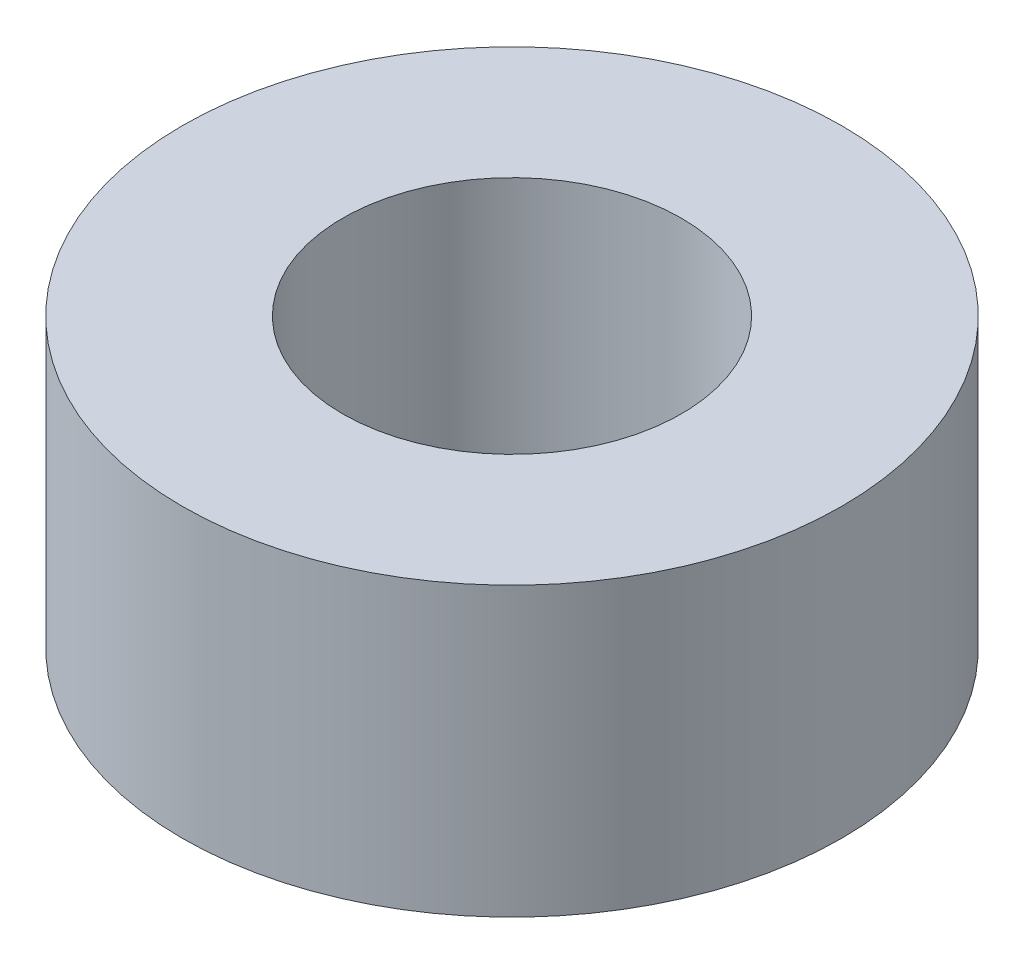
ISO-10303-21;
HEADER;
FILE_DESCRIPTION(('STEP AP214'),'2;1');
FILE_NAME('part.step','',(''),(''),'','','');
FILE_SCHEMA(('AUTOMOTIVE_DESIGN { 1 0 10303 214 1 1 1 1 }'));
ENDSEC;
DATA;
#1=APPLICATION_CONTEXT('core data for automotive mechanical design processes');
#2=APPLICATION_PROTOCOL_DEFINITION('international standard','automotive_design',2000,#1);
#3=PRODUCT_CONTEXT('',#1,'mechanical');
#4=PRODUCT('Part','Part','',(#3));
#5=PRODUCT_RELATED_PRODUCT_CATEGORY('part','',(#4));
#6=PRODUCT_DEFINITION_FORMATION('','',#4);
#7=PRODUCT_DEFINITION_CONTEXT('part definition',#1,'design');
#8=PRODUCT_DEFINITION('design','',#6,#7);
#9=PRODUCT_DEFINITION_SHAPE('','',#8);
#10=(LENGTH_UNIT() NAMED_UNIT(*) SI_UNIT(.MILLI.,.METRE.));
#11=(NAMED_UNIT(*) PLANE_ANGLE_UNIT() SI_UNIT($,.RADIAN.));
#12=(NAMED_UNIT(*) SI_UNIT($,.STERADIAN.) SOLID_ANGLE_UNIT());
#13=UNCERTAINTY_MEASURE_WITH_UNIT(LENGTH_MEASURE(1.E-05),#10,'distance_accuracy_value','');
#14=(GEOMETRIC_REPRESENTATION_CONTEXT(3) GLOBAL_UNCERTAINTY_ASSIGNED_CONTEXT((#13)) GLOBAL_UNIT_ASSIGNED_CONTEXT((#10,
#11,#12)) REPRESENTATION_CONTEXT('',''));
#15=CARTESIAN_POINT('',(0.,0.,0.));
#16=DIRECTION('',(0.,0.,1.));
#17=DIRECTION('',(1.,0.,0.));
#18=AXIS2_PLACEMENT_3D('',#15,#16,#17);
#19=CARTESIAN_POINT('',(0.,5.5372,0.));
#20=DIRECTION('',(0.,1.,0.));
#21=DIRECTION('',(0.,0.,1.));
#22=AXIS2_PLACEMENT_3D('',#19,#20,#21);
#23=PLANE('',#22);
#24=CARTESIAN_POINT('',(0.,5.5372,0.));
#25=DIRECTION('',(0.,1.,0.));
#26=DIRECTION('',(0.,0.,1.));
#27=AXIS2_PLACEMENT_3D('',#24,#25,#26);
#28=CIRCLE('',#27,6.35);
#29=CARTESIAN_POINT('',(0.,5.5372,6.35));
#30=VERTEX_POINT('',#29);
#31=EDGE_CURVE('E10',#30,#30,#28,.T.);
#32=ORIENTED_EDGE('',*,*,#31,.T.);
#33=EDGE_LOOP('',(#32));
#34=FACE_BOUND('',#33,.T.);
#35=CARTESIAN_POINT('',(0.,5.5372,0.));
#36=DIRECTION('',(0.,1.,0.));
#37=DIRECTION('',(0.,0.,1.));
#38=AXIS2_PLACEMENT_3D('',#35,#36,#37);
#39=CIRCLE('',#38,3.2639);
#40=CARTESIAN_POINT('',(0.,5.5372,3.2639));
#41=VERTEX_POINT('',#40);
#42=EDGE_CURVE('E44',#41,#41,#39,.T.);
#43=ORIENTED_EDGE('',*,*,#42,.F.);
#44=EDGE_LOOP('',(#43));
#45=FACE_BOUND('',#44,.T.);
#46=ADVANCED_FACE('F33',(#34,#45),#23,.T.);
#47=CARTESIAN_POINT('',(0.,0.,0.));
#48=DIRECTION('',(0.,1.,0.));
#49=DIRECTION('',(0.,0.,1.));
#50=AXIS2_PLACEMENT_3D('',#47,#48,#49);
#51=PLANE('',#50);
#52=CARTESIAN_POINT('',(0.,0.,0.));
#53=DIRECTION('',(0.,1.,0.));
#54=DIRECTION('',(0.,0.,1.));
#55=AXIS2_PLACEMENT_3D('',#52,#53,#54);
#56=CIRCLE('',#55,6.35);
#57=CARTESIAN_POINT('',(0.,0.,6.35));
#58=VERTEX_POINT('',#57);
#59=EDGE_CURVE('E37',#58,#58,#56,.T.);
#60=ORIENTED_EDGE('',*,*,#59,.F.);
#61=EDGE_LOOP('',(#60));
#62=FACE_BOUND('',#61,.T.);
#63=CARTESIAN_POINT('',(0.,0.,0.));
#64=DIRECTION('',(0.,1.,0.));
#65=DIRECTION('',(0.,0.,1.));
#66=AXIS2_PLACEMENT_3D('',#63,#64,#65);
#67=CIRCLE('',#66,3.2639);
#68=CARTESIAN_POINT('',(0.,0.,3.2639));
#69=VERTEX_POINT('',#68);
#70=EDGE_CURVE('E46',#69,#69,#67,.T.);
#71=ORIENTED_EDGE('',*,*,#70,.T.);
#72=EDGE_LOOP('',(#71));
#73=FACE_BOUND('',#72,.T.);
#74=ADVANCED_FACE('F56',(#62,#73),#51,.F.);
#75=CARTESIAN_POINT('',(0.,5.5372,0.));
#76=DIRECTION('',(0.,-1.,0.));
#77=DIRECTION('',(0.,0.,-1.));
#78=AXIS2_PLACEMENT_3D('',#75,#76,#77);
#79=CYLINDRICAL_SURFACE('',#78,6.35);
#80=ORIENTED_EDGE('',*,*,#31,.F.);
#81=EDGE_LOOP('',(#80));
#82=FACE_BOUND('',#81,.T.);
#83=ORIENTED_EDGE('',*,*,#59,.T.);
#84=EDGE_LOOP('',(#83));
#85=FACE_BOUND('',#84,.T.);
#86=ADVANCED_FACE('F35',(#82,#85),#79,.T.);
#87=CARTESIAN_POINT('',(0.,5.5372,0.));
#88=DIRECTION('',(0.,-1.,0.));
#89=DIRECTION('',(0.,0.,-1.));
#90=AXIS2_PLACEMENT_3D('',#87,#88,#89);
#91=CYLINDRICAL_SURFACE('',#90,3.2639);
#92=ORIENTED_EDGE('',*,*,#42,.T.);
#93=EDGE_LOOP('',(#92));
#94=FACE_BOUND('',#93,.T.);
#95=ORIENTED_EDGE('',*,*,#70,.F.);
#96=EDGE_LOOP('',(#95));
#97=FACE_BOUND('',#96,.T.);
#98=ADVANCED_FACE('F52',(#94,#97),#91,.F.);
#99=CLOSED_SHELL('',(#46,#74,#86,#98));
#100=MANIFOLD_SOLID_BREP('B2',#99);
#101=ADVANCED_BREP_SHAPE_REPRESENTATION('',(#18,#100),#14);
#102=SHAPE_DEFINITION_REPRESENTATION(#9,#101);
ENDSEC;
END-ISO-10303-21;
